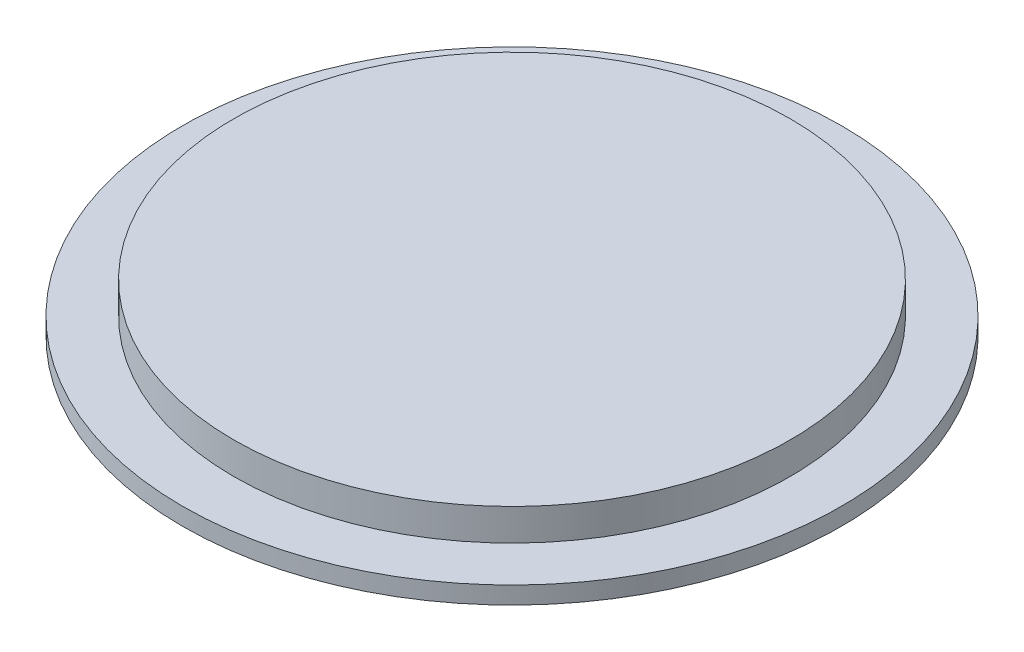
ISO-10303-21;
HEADER;
FILE_DESCRIPTION(('STEP AP214'),'2;1');
FILE_NAME('part.step','',(''),(''),'','','');
FILE_SCHEMA(('AUTOMOTIVE_DESIGN { 1 0 10303 214 1 1 1 1 }'));
ENDSEC;
DATA;
#1=APPLICATION_CONTEXT('core data for automotive mechanical design processes');
#2=APPLICATION_PROTOCOL_DEFINITION('international standard','automotive_design',2000,#1);
#3=PRODUCT_CONTEXT('',#1,'mechanical');
#4=PRODUCT('Part','Part','',(#3));
#5=PRODUCT_RELATED_PRODUCT_CATEGORY('part','',(#4));
#6=PRODUCT_DEFINITION_FORMATION('','',#4);
#7=PRODUCT_DEFINITION_CONTEXT('part definition',#1,'design');
#8=PRODUCT_DEFINITION('design','',#6,#7);
#9=PRODUCT_DEFINITION_SHAPE('','',#8);
#10=(LENGTH_UNIT() NAMED_UNIT(*) SI_UNIT(.MILLI.,.METRE.));
#11=(NAMED_UNIT(*) PLANE_ANGLE_UNIT() SI_UNIT($,.RADIAN.));
#12=(NAMED_UNIT(*) SI_UNIT($,.STERADIAN.) SOLID_ANGLE_UNIT());
#13=UNCERTAINTY_MEASURE_WITH_UNIT(LENGTH_MEASURE(1.E-05),#10,'distance_accuracy_value','');
#14=(GEOMETRIC_REPRESENTATION_CONTEXT(3) GLOBAL_UNCERTAINTY_ASSIGNED_CONTEXT((#13)) GLOBAL_UNIT_ASSIGNED_CONTEXT((#10,
#11,#12)) REPRESENTATION_CONTEXT('',''));
#15=CARTESIAN_POINT('',(0.,0.,0.));
#16=DIRECTION('',(0.,0.,1.));
#17=DIRECTION('',(1.,0.,0.));
#18=AXIS2_PLACEMENT_3D('',#15,#16,#17);
#19=CARTESIAN_POINT('',(0.,2.8702,0.));
#20=DIRECTION('',(0.,-1.,0.));
#21=DIRECTION('',(0.,0.,-1.));
#22=AXIS2_PLACEMENT_3D('',#19,#20,#21);
#23=CYLINDRICAL_SURFACE('',#22,16.256);
#24=CARTESIAN_POINT('',(0.,2.8702,0.));
#25=DIRECTION('',(0.,1.,0.));
#26=DIRECTION('',(0.,0.,1.));
#27=AXIS2_PLACEMENT_3D('',#24,#25,#26);
#28=CIRCLE('',#27,16.256);
#29=CARTESIAN_POINT('',(0.,2.8702,16.256));
#30=VERTEX_POINT('',#29);
#31=EDGE_CURVE('E51',#30,#30,#28,.T.);
#32=ORIENTED_EDGE('',*,*,#31,.F.);
#33=EDGE_LOOP('',(#32));
#34=FACE_BOUND('',#33,.T.);
#35=CARTESIAN_POINT('',(0.,1.016,0.));
#36=DIRECTION('',(0.,-1.,0.));
#37=DIRECTION('',(0.,0.,-1.));
#38=AXIS2_PLACEMENT_3D('',#35,#36,#37);
#39=CIRCLE('',#38,16.256);
#40=CARTESIAN_POINT('',(0.,1.016,-16.256));
#41=VERTEX_POINT('',#40);
#42=EDGE_CURVE('E10',#41,#41,#39,.T.);
#43=ORIENTED_EDGE('',*,*,#42,.F.);
#44=EDGE_LOOP('',(#43));
#45=FACE_BOUND('',#44,.T.);
#46=ADVANCED_FACE('F45',(#34,#45),#23,.T.);
#47=CARTESIAN_POINT('',(0.,2.8702,0.));
#48=DIRECTION('',(0.,1.,0.));
#49=DIRECTION('',(0.,0.,1.));
#50=AXIS2_PLACEMENT_3D('',#47,#48,#49);
#51=PLANE('',#50);
#52=ORIENTED_EDGE('',*,*,#31,.T.);
#53=EDGE_LOOP('',(#52));
#54=FACE_BOUND('',#53,.T.);
#55=ADVANCED_FACE('F70',(#54),#51,.T.);
#56=CARTESIAN_POINT('',(0.,1.016,0.));
#57=DIRECTION('',(0.,-1.,0.));
#58=DIRECTION('',(0.,0.,-1.));
#59=AXIS2_PLACEMENT_3D('',#56,#57,#58);
#60=CYLINDRICAL_SURFACE('',#59,19.256);
#61=CARTESIAN_POINT('',(0.,1.016,0.));
#62=DIRECTION('',(0.,-1.,0.));
#63=DIRECTION('',(0.,0.,-1.));
#64=AXIS2_PLACEMENT_3D('',#61,#62,#63);
#65=CIRCLE('',#64,19.256);
#66=CARTESIAN_POINT('',(0.,1.016,-19.256));
#67=VERTEX_POINT('',#66);
#68=EDGE_CURVE('E55',#67,#67,#65,.T.);
#69=ORIENTED_EDGE('',*,*,#68,.T.);
#70=EDGE_LOOP('',(#69));
#71=FACE_BOUND('',#70,.T.);
#72=CARTESIAN_POINT('',(0.,0.,0.));
#73=DIRECTION('',(0.,-1.,0.));
#74=DIRECTION('',(0.,0.,-1.));
#75=AXIS2_PLACEMENT_3D('',#72,#73,#74);
#76=CIRCLE('',#75,19.256);
#77=CARTESIAN_POINT('',(0.,0.,-19.256));
#78=VERTEX_POINT('',#77);
#79=EDGE_CURVE('E59',#78,#78,#76,.T.);
#80=ORIENTED_EDGE('',*,*,#79,.F.);
#81=EDGE_LOOP('',(#80));
#82=FACE_BOUND('',#81,.T.);
#83=ADVANCED_FACE('F67',(#71,#82),#60,.T.);
#84=CARTESIAN_POINT('',(0.,1.016,0.));
#85=DIRECTION('',(0.,-1.,0.));
#86=DIRECTION('',(0.,0.,-1.));
#87=AXIS2_PLACEMENT_3D('',#84,#85,#86);
#88=PLANE('',#87);
#89=ORIENTED_EDGE('',*,*,#42,.T.);
#90=EDGE_LOOP('',(#89));
#91=FACE_BOUND('',#90,.T.);
#92=ORIENTED_EDGE('',*,*,#68,.F.);
#93=EDGE_LOOP('',(#92));
#94=FACE_BOUND('',#93,.T.);
#95=ADVANCED_FACE('F69',(#91,#94),#88,.F.);
#96=CARTESIAN_POINT('',(0.,0.,0.));
#97=DIRECTION('',(0.,1.,0.));
#98=DIRECTION('',(0.,0.,1.));
#99=AXIS2_PLACEMENT_3D('',#96,#97,#98);
#100=PLANE('',#99);
#101=ORIENTED_EDGE('',*,*,#79,.T.);
#102=EDGE_LOOP('',(#101));
#103=FACE_BOUND('',#102,.T.);
#104=ADVANCED_FACE('F65',(#103),#100,.F.);
#105=CLOSED_SHELL('',(#46,#55,#83,#95,#104));
#106=MANIFOLD_SOLID_BREP('B2',#105);
#107=ADVANCED_BREP_SHAPE_REPRESENTATION('',(#18,#106),#14);
#108=SHAPE_DEFINITION_REPRESENTATION(#9,#107);
ENDSEC;
END-ISO-10303-21;
